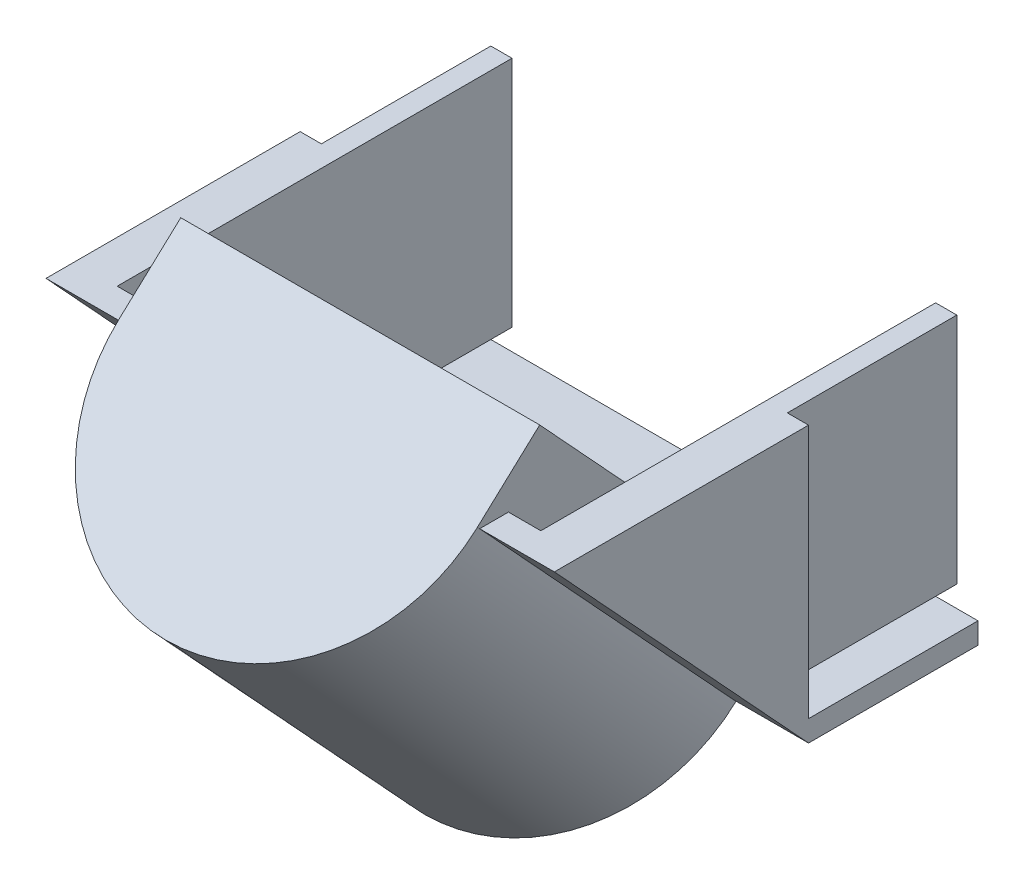
ISO-10303-21;
HEADER;
FILE_DESCRIPTION(('STEP AP214'),'2;1');
FILE_NAME('part.step','',(''),(''),'','','');
FILE_SCHEMA(('AUTOMOTIVE_DESIGN { 1 0 10303 214 1 1 1 1 }'));
ENDSEC;
DATA;
#1=APPLICATION_CONTEXT('core data for automotive mechanical design processes');
#2=APPLICATION_PROTOCOL_DEFINITION('international standard','automotive_design',2000,#1);
#3=PRODUCT_CONTEXT('',#1,'mechanical');
#4=PRODUCT('Part','Part','',(#3));
#5=PRODUCT_RELATED_PRODUCT_CATEGORY('part','',(#4));
#6=PRODUCT_DEFINITION_FORMATION('','',#4);
#7=PRODUCT_DEFINITION_CONTEXT('part definition',#1,'design');
#8=PRODUCT_DEFINITION('design','',#6,#7);
#9=PRODUCT_DEFINITION_SHAPE('','',#8);
#10=(LENGTH_UNIT() NAMED_UNIT(*) SI_UNIT(.MILLI.,.METRE.));
#11=(NAMED_UNIT(*) PLANE_ANGLE_UNIT() SI_UNIT($,.RADIAN.));
#12=(NAMED_UNIT(*) SI_UNIT($,.STERADIAN.) SOLID_ANGLE_UNIT());
#13=UNCERTAINTY_MEASURE_WITH_UNIT(LENGTH_MEASURE(1.E-05),#10,'distance_accuracy_value','');
#14=(GEOMETRIC_REPRESENTATION_CONTEXT(3) GLOBAL_UNCERTAINTY_ASSIGNED_CONTEXT((#13)) GLOBAL_UNIT_ASSIGNED_CONTEXT((#10,
#11,#12)) REPRESENTATION_CONTEXT('',''));
#15=CARTESIAN_POINT('',(0.,0.,0.));
#16=DIRECTION('',(0.,0.,1.));
#17=DIRECTION('',(1.,0.,0.));
#18=AXIS2_PLACEMENT_3D('',#15,#16,#17);
#19=CARTESIAN_POINT('',(-76.2,82.55,0.));
#20=DIRECTION('',(0.,1.,0.));
#21=DIRECTION('',(0.,0.,1.));
#22=AXIS2_PLACEMENT_3D('',#19,#20,#21);
#23=PLANE('',#22);
#24=DIRECTION('',(0.,0.,-1.));
#25=VECTOR('',#24,1.);
#26=CARTESIAN_POINT('',(53.798871558755,82.55,0.));
#27=LINE('',#26,#25);
#28=CARTESIAN_POINT('',(53.798871558755,82.55,76.2));
#29=VERTEX_POINT('',#28);
#30=CARTESIAN_POINT('',(53.7988715587551,82.55,67.5582332167494));
#31=VERTEX_POINT('',#30);
#32=EDGE_CURVE('E320',#29,#31,#27,.T.);
#33=ORIENTED_EDGE('',*,*,#32,.F.);
#34=DIRECTION('',(1.,0.,0.));
#35=VECTOR('',#34,1.);
#36=CARTESIAN_POINT('',(-76.2,82.55,76.2));
#37=LINE('',#36,#35);
#38=CARTESIAN_POINT('',(76.2,82.55,76.2));
#39=VERTEX_POINT('',#38);
#40=EDGE_CURVE('E488',#29,#39,#37,.T.);
#41=ORIENTED_EDGE('',*,*,#40,.T.);
#42=DIRECTION('',(0.,0.,1.));
#43=VECTOR('',#42,1.);
#44=CARTESIAN_POINT('',(76.2,82.55,0.));
#45=LINE('',#44,#43);
#46=CARTESIAN_POINT('',(76.2,82.55,0.));
#47=VERTEX_POINT('',#46);
#48=EDGE_CURVE('E398',#47,#39,#45,.T.);
#49=ORIENTED_EDGE('',*,*,#48,.F.);
#50=DIRECTION('',(1.,0.,0.));
#51=VECTOR('',#50,1.);
#52=CARTESIAN_POINT('',(-76.2,82.55,0.));
#53=LINE('',#52,#51);
#54=CARTESIAN_POINT('',(69.85,82.55,0.));
#55=VERTEX_POINT('',#54);
#56=EDGE_CURVE('E493',#55,#47,#53,.T.);
#57=ORIENTED_EDGE('',*,*,#56,.F.);
#58=DIRECTION('',(0.,0.,1.));
#59=VECTOR('',#58,1.);
#60=CARTESIAN_POINT('',(69.85,82.55,-50.8));
#61=LINE('',#60,#59);
#62=CARTESIAN_POINT('',(69.85,82.55,-50.8));
#63=VERTEX_POINT('',#62);
#64=EDGE_CURVE('E411',#63,#55,#61,.T.);
#65=ORIENTED_EDGE('',*,*,#64,.F.);
#66=DIRECTION('',(1.,0.,0.));
#67=VECTOR('',#66,1.);
#68=CARTESIAN_POINT('',(69.85,82.55,-50.8));
#69=LINE('',#68,#67);
#70=CARTESIAN_POINT('',(63.5,82.55,-50.8));
#71=VERTEX_POINT('',#70);
#72=EDGE_CURVE('E415',#71,#63,#69,.T.);
#73=ORIENTED_EDGE('',*,*,#72,.F.);
#74=DIRECTION('',(0.,0.,1.));
#75=VECTOR('',#74,1.);
#76=CARTESIAN_POINT('',(63.5,82.55,-50.8));
#77=LINE('',#76,#75);
#78=CARTESIAN_POINT('',(63.4999999999999,82.55,67.5582332167494));
#79=VERTEX_POINT('',#78);
#80=EDGE_CURVE('E407',#71,#79,#77,.T.);
#81=ORIENTED_EDGE('',*,*,#80,.T.);
#82=DIRECTION('',(1.,0.,0.));
#83=VECTOR('',#82,1.);
#84=CARTESIAN_POINT('',(63.4999999999999,82.55,67.5582332167494));
#85=LINE('',#84,#83);
#86=EDGE_CURVE('E353',#31,#79,#85,.T.);
#87=ORIENTED_EDGE('',*,*,#86,.F.);
#88=EDGE_LOOP('',(#33,#41,#49,#57,#65,#73,#81,#87));
#89=FACE_BOUND('',#88,.T.);
#90=ADVANCED_FACE('F49',(#89),#23,.T.);
#91=CARTESIAN_POINT('',(-76.2,0.,0.));
#92=DIRECTION('',(0.,0.,-1.));
#93=DIRECTION('',(-1.,0.,0.));
#94=AXIS2_PLACEMENT_3D('',#91,#92,#93);
#95=PLANE('',#94);
#96=DIRECTION('',(0.,-1.,0.));
#97=VECTOR('',#96,1.);
#98=CARTESIAN_POINT('',(53.7988715587551,0.,0.));
#99=LINE('',#98,#97);
#100=CARTESIAN_POINT('',(53.798871558755,12.6999999999999,0.));
#101=VERTEX_POINT('',#100);
#102=CARTESIAN_POINT('',(53.7988715587551,6.35,0.));
#103=VERTEX_POINT('',#102);
#104=EDGE_CURVE('E317',#101,#103,#99,.T.);
#105=ORIENTED_EDGE('',*,*,#104,.F.);
#106=DIRECTION('',(-1.,0.,0.));
#107=VECTOR('',#106,1.);
#108=CARTESIAN_POINT('',(63.4999999999999,12.6999999999999,0.));
#109=LINE('',#108,#107);
#110=CARTESIAN_POINT('',(63.4999999999999,12.6999999999999,0.));
#111=VERTEX_POINT('',#110);
#112=EDGE_CURVE('E334',#111,#101,#109,.T.);
#113=ORIENTED_EDGE('',*,*,#112,.F.);
#114=DIRECTION('',(-1.,0.,0.));
#115=VECTOR('',#114,1.);
#116=CARTESIAN_POINT('',(69.85,12.7,0.));
#117=LINE('',#116,#115);
#118=CARTESIAN_POINT('',(69.85,12.7,0.));
#119=VERTEX_POINT('',#118);
#120=EDGE_CURVE('E73',#119,#111,#117,.T.);
#121=ORIENTED_EDGE('',*,*,#120,.F.);
#122=DIRECTION('',(0.,-1.,0.));
#123=VECTOR('',#122,1.);
#124=CARTESIAN_POINT('',(69.85,82.55,0.));
#125=LINE('',#124,#123);
#126=EDGE_CURVE('E418',#55,#119,#125,.T.);
#127=ORIENTED_EDGE('',*,*,#126,.F.);
#128=ORIENTED_EDGE('',*,*,#56,.T.);
#129=DIRECTION('',(0.,1.,0.));
#130=VECTOR('',#129,1.);
#131=CARTESIAN_POINT('',(76.2,0.,0.));
#132=LINE('',#131,#130);
#133=CARTESIAN_POINT('',(76.2,6.35,0.));
#134=VERTEX_POINT('',#133);
#135=EDGE_CURVE('E475',#134,#47,#132,.T.);
#136=ORIENTED_EDGE('',*,*,#135,.F.);
#137=DIRECTION('',(1.,0.,0.));
#138=VECTOR('',#137,1.);
#139=CARTESIAN_POINT('',(76.2,6.35,0.));
#140=LINE('',#139,#138);
#141=EDGE_CURVE('E382',#103,#134,#140,.T.);
#142=ORIENTED_EDGE('',*,*,#141,.F.);
#143=EDGE_LOOP('',(#105,#113,#121,#127,#128,#136,#142));
#144=FACE_BOUND('',#143,.T.);
#145=ADVANCED_FACE('F519',(#144),#95,.T.);
#146=CARTESIAN_POINT('',(-76.2,82.55,76.2));
#147=DIRECTION('',(0.,-0.678280102733066,0.734803444627488));
#148=DIRECTION('',(0.,-0.734803444627488,-0.678280102733066));
#149=AXIS2_PLACEMENT_3D('',#146,#147,#148);
#150=PLANE('',#149);
#151=ORIENTED_EDGE('',*,*,#40,.F.);
#152=DIRECTION('',(0.,0.734803444627488,0.678280102733066));
#153=VECTOR('',#152,1.);
#154=CARTESIAN_POINT('',(53.798871558755,-0.719016860460955,-0.663707871194699));
#155=LINE('',#154,#153);
#156=CARTESIAN_POINT('',(53.798871558755,0.,0.));
#157=VERTEX_POINT('',#156);
#158=EDGE_CURVE('E287',#157,#29,#155,.T.);
#159=ORIENTED_EDGE('',*,*,#158,.F.);
#160=DIRECTION('',(1.,0.,0.));
#161=VECTOR('',#160,1.);
#162=CARTESIAN_POINT('',(-76.2,0.,0.));
#163=LINE('',#162,#161);
#164=CARTESIAN_POINT('',(76.2,0.,0.));
#165=VERTEX_POINT('',#164);
#166=EDGE_CURVE('E498',#157,#165,#163,.T.);
#167=ORIENTED_EDGE('',*,*,#166,.T.);
#168=DIRECTION('',(0.,-0.734803444627488,-0.678280102733066));
#169=VECTOR('',#168,1.);
#170=CARTESIAN_POINT('',(76.2,82.55,76.2));
#171=LINE('',#170,#169);
#172=EDGE_CURVE('E471',#39,#165,#171,.T.);
#173=ORIENTED_EDGE('',*,*,#172,.F.);
#174=EDGE_LOOP('',(#151,#159,#167,#173));
#175=FACE_BOUND('',#174,.T.);
#176=ADVANCED_FACE('F563',(#175),#150,.T.);
#177=CARTESIAN_POINT('',(-76.2,86.8570786523549,71.5339981266155));
#178=DIRECTION('',(0.,-0.678280102733066,0.734803444627488));
#179=DIRECTION('',(0.,-0.734803444627488,-0.678280102733066));
#180=AXIS2_PLACEMENT_3D('',#177,#178,#179);
#181=PLANE('',#180);
#182=DIRECTION('',(-1.,0.,0.));
#183=VECTOR('',#182,1.);
#184=CARTESIAN_POINT('',(63.4999999999999,12.6999999999999,3.08131013982618));
#185=LINE('',#184,#183);
#186=CARTESIAN_POINT('',(63.4999999999999,12.6999999999999,3.08131013982618));
#187=VERTEX_POINT('',#186);
#188=CARTESIAN_POINT('',(53.798871558755,12.6999999999999,3.08131013982624));
#189=VERTEX_POINT('',#188);
#190=EDGE_CURVE('E339',#187,#189,#185,.T.);
#191=ORIENTED_EDGE('',*,*,#190,.T.);
#192=DIRECTION('',(0.,0.734803444627488,0.678280102733066));
#193=VECTOR('',#192,1.);
#194=CARTESIAN_POINT('',(53.7988715587551,86.8570786523549,71.5339981266155));
#195=LINE('',#194,#193);
#196=EDGE_CURVE('E313',#189,#31,#195,.T.);
#197=ORIENTED_EDGE('',*,*,#196,.T.);
#198=ORIENTED_EDGE('',*,*,#86,.T.);
#199=DIRECTION('',(0.,-0.734803444627488,-0.678280102733066));
#200=VECTOR('',#199,1.);
#201=CARTESIAN_POINT('',(63.4999999999999,154.922167069017,134.363310511226));
#202=LINE('',#201,#200);
#203=EDGE_CURVE('E344',#79,#187,#202,.T.);
#204=ORIENTED_EDGE('',*,*,#203,.T.);
#205=EDGE_LOOP('',(#191,#197,#198,#204));
#206=FACE_BOUND('',#205,.T.);
#207=ADVANCED_FACE('F510',(#206),#181,.F.);
#208=CARTESIAN_POINT('',(63.4999999999999,12.6999999999999,212.766491502661));
#209=DIRECTION('',(0.,-1.,0.));
#210=DIRECTION('',(0.,0.,-1.));
#211=AXIS2_PLACEMENT_3D('',#208,#209,#210);
#212=PLANE('',#211);
#213=ORIENTED_EDGE('',*,*,#112,.T.);
#214=DIRECTION('',(0.,0.,1.));
#215=VECTOR('',#214,1.);
#216=CARTESIAN_POINT('',(53.7988715587551,12.6999999999999,212.766491502661));
#217=LINE('',#216,#215);
#218=EDGE_CURVE('E58',#101,#189,#217,.T.);
#219=ORIENTED_EDGE('',*,*,#218,.T.);
#220=ORIENTED_EDGE('',*,*,#190,.F.);
#221=DIRECTION('',(0.,0.,-1.));
#222=VECTOR('',#221,1.);
#223=CARTESIAN_POINT('',(63.4999999999999,12.6999999999999,212.766491502661));
#224=LINE('',#223,#222);
#225=EDGE_CURVE('E348',#187,#111,#224,.T.);
#226=ORIENTED_EDGE('',*,*,#225,.T.);
#227=EDGE_LOOP('',(#213,#219,#220,#226));
#228=FACE_BOUND('',#227,.T.);
#229=ADVANCED_FACE('F507',(#228),#212,.F.);
#230=DIRECTION('',(0.,0.,1.));
#231=VECTOR('',#230,1.);
#232=CARTESIAN_POINT('',(-53.798871558755,82.55,0.));
#233=LINE('',#232,#231);
#234=CARTESIAN_POINT('',(-53.798871558755,82.55,67.5582332167494));
#235=VERTEX_POINT('',#234);
#236=CARTESIAN_POINT('',(-53.798871558755,82.55,76.2));
#237=VERTEX_POINT('',#236);
#238=EDGE_CURVE('E302',#235,#237,#233,.T.);
#239=ORIENTED_EDGE('',*,*,#238,.F.);
#240=CARTESIAN_POINT('',(-63.5,82.55,67.5582332167493));
#241=VERTEX_POINT('',#240);
#242=EDGE_CURVE('E349',#241,#235,#85,.T.);
#243=ORIENTED_EDGE('',*,*,#242,.F.);
#244=DIRECTION('',(0.,0.,1.));
#245=VECTOR('',#244,1.);
#246=CARTESIAN_POINT('',(-63.5000000000001,82.5499999999999,-50.8));
#247=LINE('',#246,#245);
#248=CARTESIAN_POINT('',(-63.5000000000001,82.5499999999999,-50.8));
#249=VERTEX_POINT('',#248);
#250=EDGE_CURVE('E437',#249,#241,#247,.T.);
#251=ORIENTED_EDGE('',*,*,#250,.F.);
#252=DIRECTION('',(1.,0.,0.));
#253=VECTOR('',#252,1.);
#254=CARTESIAN_POINT('',(-69.8500000000001,82.5499999999999,-50.8));
#255=LINE('',#254,#253);
#256=CARTESIAN_POINT('',(-69.8500000000001,82.5499999999999,-50.8));
#257=VERTEX_POINT('',#256);
#258=EDGE_CURVE('E462',#257,#249,#255,.T.);
#259=ORIENTED_EDGE('',*,*,#258,.F.);
#260=DIRECTION('',(0.,0.,1.));
#261=VECTOR('',#260,1.);
#262=CARTESIAN_POINT('',(-69.8500000000001,82.5499999999999,-50.8));
#263=LINE('',#262,#261);
#264=CARTESIAN_POINT('',(-69.85,82.55,0.));
#265=VERTEX_POINT('',#264);
#266=EDGE_CURVE('E363',#257,#265,#263,.T.);
#267=ORIENTED_EDGE('',*,*,#266,.T.);
#268=CARTESIAN_POINT('',(-76.2,82.55,0.));
#269=VERTEX_POINT('',#268);
#270=EDGE_CURVE('E489',#269,#265,#53,.T.);
#271=ORIENTED_EDGE('',*,*,#270,.F.);
#272=DIRECTION('',(0.,0.,1.));
#273=VECTOR('',#272,1.);
#274=CARTESIAN_POINT('',(-76.2,82.55,0.));
#275=LINE('',#274,#273);
#276=CARTESIAN_POINT('',(-76.2,82.55,76.2));
#277=VERTEX_POINT('',#276);
#278=EDGE_CURVE('E478',#269,#277,#275,.T.);
#279=ORIENTED_EDGE('',*,*,#278,.T.);
#280=EDGE_CURVE('E499',#277,#237,#37,.T.);
#281=ORIENTED_EDGE('',*,*,#280,.T.);
#282=EDGE_LOOP('',(#239,#243,#251,#259,#267,#271,#279,#281));
#283=FACE_BOUND('',#282,.T.);
#284=ADVANCED_FACE('F51',(#283),#23,.T.);
#285=DIRECTION('',(0.,1.,0.));
#286=VECTOR('',#285,1.);
#287=CARTESIAN_POINT('',(-53.798871558755,0.,0.));
#288=LINE('',#287,#286);
#289=CARTESIAN_POINT('',(-53.798871558755,6.35,0.));
#290=VERTEX_POINT('',#289);
#291=CARTESIAN_POINT('',(-53.798871558755,12.6999999999999,0.));
#292=VERTEX_POINT('',#291);
#293=EDGE_CURVE('E65',#290,#292,#288,.T.);
#294=ORIENTED_EDGE('',*,*,#293,.F.);
#295=CARTESIAN_POINT('',(-76.2,6.35,0.));
#296=VERTEX_POINT('',#295);
#297=EDGE_CURVE('E369',#296,#290,#140,.T.);
#298=ORIENTED_EDGE('',*,*,#297,.F.);
#299=DIRECTION('',(0.,1.,0.));
#300=VECTOR('',#299,1.);
#301=CARTESIAN_POINT('',(-76.2,0.,0.));
#302=LINE('',#301,#300);
#303=EDGE_CURVE('E485',#296,#269,#302,.T.);
#304=ORIENTED_EDGE('',*,*,#303,.T.);
#305=ORIENTED_EDGE('',*,*,#270,.T.);
#306=DIRECTION('',(0.,1.,0.));
#307=VECTOR('',#306,1.);
#308=CARTESIAN_POINT('',(-69.8500000000001,82.5499999999999,0.));
#309=LINE('',#308,#307);
#310=CARTESIAN_POINT('',(-69.85,12.6999999999999,0.));
#311=VERTEX_POINT('',#310);
#312=EDGE_CURVE('E403',#311,#265,#309,.T.);
#313=ORIENTED_EDGE('',*,*,#312,.F.);
#314=DIRECTION('',(-1.,0.,0.));
#315=VECTOR('',#314,1.);
#316=CARTESIAN_POINT('',(-69.85,12.6999999999999,0.));
#317=LINE('',#316,#315);
#318=CARTESIAN_POINT('',(-63.5,12.6999999999999,0.));
#319=VERTEX_POINT('',#318);
#320=EDGE_CURVE('E449',#319,#311,#317,.T.);
#321=ORIENTED_EDGE('',*,*,#320,.F.);
#322=EDGE_CURVE('E333',#292,#319,#109,.T.);
#323=ORIENTED_EDGE('',*,*,#322,.F.);
#324=EDGE_LOOP('',(#294,#298,#304,#305,#313,#321,#323));
#325=FACE_BOUND('',#324,.T.);
#326=ADVANCED_FACE('F574',(#325),#95,.T.);
#327=DIRECTION('',(0.,0.734803444627488,0.678280102733066));
#328=VECTOR('',#327,1.);
#329=CARTESIAN_POINT('',(-53.798871558755,-0.719016860460955,-0.663707871194699));
#330=LINE('',#329,#328);
#331=CARTESIAN_POINT('',(-53.798871558755,0.,0.));
#332=VERTEX_POINT('',#331);
#333=EDGE_CURVE('E293',#332,#237,#330,.T.);
#334=ORIENTED_EDGE('',*,*,#333,.T.);
#335=ORIENTED_EDGE('',*,*,#280,.F.);
#336=DIRECTION('',(0.,-0.734803444627488,-0.678280102733066));
#337=VECTOR('',#336,1.);
#338=CARTESIAN_POINT('',(-76.2,82.55,76.2));
#339=LINE('',#338,#337);
#340=CARTESIAN_POINT('',(-76.2,0.,0.));
#341=VERTEX_POINT('',#340);
#342=EDGE_CURVE('E482',#277,#341,#339,.T.);
#343=ORIENTED_EDGE('',*,*,#342,.T.);
#344=EDGE_CURVE('E494',#341,#332,#163,.T.);
#345=ORIENTED_EDGE('',*,*,#344,.T.);
#346=EDGE_LOOP('',(#334,#335,#343,#345));
#347=FACE_BOUND('',#346,.T.);
#348=ADVANCED_FACE('F607',(#347),#150,.T.);
#349=CARTESIAN_POINT('',(-76.2,0.,0.));
#350=DIRECTION('',(-1.,0.,0.));
#351=DIRECTION('',(0.,0.,1.));
#352=AXIS2_PLACEMENT_3D('',#349,#350,#351);
#353=PLANE('',#352);
#354=ORIENTED_EDGE('',*,*,#278,.F.);
#355=ORIENTED_EDGE('',*,*,#303,.F.);
#356=DIRECTION('',(0.,0.,1.));
#357=VECTOR('',#356,1.);
#358=CARTESIAN_POINT('',(-76.2,6.35,-50.8));
#359=LINE('',#358,#357);
#360=CARTESIAN_POINT('',(-76.2,6.35,-50.8));
#361=VERTEX_POINT('',#360);
#362=EDGE_CURVE('E386',#361,#296,#359,.T.);
#363=ORIENTED_EDGE('',*,*,#362,.F.);
#364=DIRECTION('',(0.,1.,0.));
#365=VECTOR('',#364,1.);
#366=CARTESIAN_POINT('',(-76.2,0.,-50.8));
#367=LINE('',#366,#365);
#368=CARTESIAN_POINT('',(-76.2,0.,-50.8));
#369=VERTEX_POINT('',#368);
#370=EDGE_CURVE('E372',#369,#361,#367,.T.);
#371=ORIENTED_EDGE('',*,*,#370,.F.);
#372=DIRECTION('',(0.,0.,1.));
#373=VECTOR('',#372,1.);
#374=CARTESIAN_POINT('',(-76.2,0.,-50.8));
#375=LINE('',#374,#373);
#376=EDGE_CURVE('E390',#369,#341,#375,.T.);
#377=ORIENTED_EDGE('',*,*,#376,.T.);
#378=ORIENTED_EDGE('',*,*,#342,.F.);
#379=EDGE_LOOP('',(#354,#355,#363,#371,#377,#378));
#380=FACE_BOUND('',#379,.T.);
#381=ADVANCED_FACE('F581',(#380),#353,.T.);
#382=CARTESIAN_POINT('',(76.2,0.,0.));
#383=DIRECTION('',(-1.,0.,0.));
#384=DIRECTION('',(0.,0.,1.));
#385=AXIS2_PLACEMENT_3D('',#382,#383,#384);
#386=PLANE('',#385);
#387=ORIENTED_EDGE('',*,*,#48,.T.);
#388=ORIENTED_EDGE('',*,*,#172,.T.);
#389=DIRECTION('',(0.,0.,1.));
#390=VECTOR('',#389,1.);
#391=CARTESIAN_POINT('',(76.2,0.,-50.8));
#392=LINE('',#391,#390);
#393=CARTESIAN_POINT('',(76.2,0.,-50.8));
#394=VERTEX_POINT('',#393);
#395=EDGE_CURVE('E394',#394,#165,#392,.T.);
#396=ORIENTED_EDGE('',*,*,#395,.F.);
#397=DIRECTION('',(0.,-1.,0.));
#398=VECTOR('',#397,1.);
#399=CARTESIAN_POINT('',(76.2,0.,-50.8));
#400=LINE('',#399,#398);
#401=CARTESIAN_POINT('',(76.2,6.35,-50.8));
#402=VERTEX_POINT('',#401);
#403=EDGE_CURVE('E364',#402,#394,#400,.T.);
#404=ORIENTED_EDGE('',*,*,#403,.F.);
#405=DIRECTION('',(0.,0.,1.));
#406=VECTOR('',#405,1.);
#407=CARTESIAN_POINT('',(76.2,6.35,-50.8));
#408=LINE('',#407,#406);
#409=EDGE_CURVE('E378',#402,#134,#408,.T.);
#410=ORIENTED_EDGE('',*,*,#409,.T.);
#411=ORIENTED_EDGE('',*,*,#135,.T.);
#412=EDGE_LOOP('',(#387,#388,#396,#404,#410,#411));
#413=FACE_BOUND('',#412,.T.);
#414=ADVANCED_FACE('F566',(#413),#386,.F.);
#415=CARTESIAN_POINT('',(-69.8500000000001,82.5499999999999,-50.8));
#416=DIRECTION('',(1.,0.,0.));
#417=DIRECTION('',(0.,1.,0.));
#418=AXIS2_PLACEMENT_3D('',#415,#416,#417);
#419=PLANE('',#418);
#420=ORIENTED_EDGE('',*,*,#312,.T.);
#421=ORIENTED_EDGE('',*,*,#266,.F.);
#422=DIRECTION('',(0.,1.,0.));
#423=VECTOR('',#422,1.);
#424=CARTESIAN_POINT('',(-69.8500000000001,82.5499999999999,-50.8));
#425=LINE('',#424,#423);
#426=CARTESIAN_POINT('',(-69.85,12.6999999999999,-50.8));
#427=VERTEX_POINT('',#426);
#428=EDGE_CURVE('E453',#427,#257,#425,.T.);
#429=ORIENTED_EDGE('',*,*,#428,.F.);
#430=DIRECTION('',(0.,0.,1.));
#431=VECTOR('',#430,1.);
#432=CARTESIAN_POINT('',(-69.85,12.6999999999999,-50.8));
#433=LINE('',#432,#431);
#434=EDGE_CURVE('E444',#427,#311,#433,.T.);
#435=ORIENTED_EDGE('',*,*,#434,.T.);
#436=EDGE_LOOP('',(#420,#421,#429,#435));
#437=FACE_BOUND('',#436,.T.);
#438=ADVANCED_FACE('F589',(#437),#419,.F.);
#439=CARTESIAN_POINT('',(-63.5000000000001,82.5499999999999,-50.8));
#440=DIRECTION('',(-1.,0.,0.));
#441=DIRECTION('',(0.,-1.,0.));
#442=AXIS2_PLACEMENT_3D('',#439,#440,#441);
#443=PLANE('',#442);
#444=ORIENTED_EDGE('',*,*,#250,.T.);
#445=DIRECTION('',(0.,0.734803444627488,0.678280102733066));
#446=VECTOR('',#445,1.);
#447=CARTESIAN_POINT('',(-63.5,154.922167069017,134.363310511226));
#448=LINE('',#447,#446);
#449=CARTESIAN_POINT('',(-63.5,12.6999999999999,3.08131013982624));
#450=VERTEX_POINT('',#449);
#451=EDGE_CURVE('E354',#450,#241,#448,.T.);
#452=ORIENTED_EDGE('',*,*,#451,.F.);
#453=DIRECTION('',(0.,0.,-1.));
#454=VECTOR('',#453,1.);
#455=CARTESIAN_POINT('',(-63.5,12.6999999999999,212.766491502661));
#456=LINE('',#455,#454);
#457=EDGE_CURVE('E343',#450,#319,#456,.T.);
#458=ORIENTED_EDGE('',*,*,#457,.T.);
#459=DIRECTION('',(0.,0.,1.));
#460=VECTOR('',#459,1.);
#461=CARTESIAN_POINT('',(-63.5,12.6999999999999,-50.8));
#462=LINE('',#461,#460);
#463=CARTESIAN_POINT('',(-63.5,12.6999999999999,-50.8));
#464=VERTEX_POINT('',#463);
#465=EDGE_CURVE('E440',#464,#319,#462,.T.);
#466=ORIENTED_EDGE('',*,*,#465,.F.);
#467=DIRECTION('',(0.,-1.,0.));
#468=VECTOR('',#467,1.);
#469=CARTESIAN_POINT('',(-63.5000000000001,82.5499999999999,-50.8));
#470=LINE('',#469,#468);
#471=EDGE_CURVE('E459',#249,#464,#470,.T.);
#472=ORIENTED_EDGE('',*,*,#471,.F.);
#473=EDGE_LOOP('',(#444,#452,#458,#466,#472));
#474=FACE_BOUND('',#473,.T.);
#475=ADVANCED_FACE('F597',(#474),#443,.F.);
#476=CARTESIAN_POINT('',(-69.85,12.6999999999999,-50.8));
#477=DIRECTION('',(0.,1.,0.));
#478=DIRECTION('',(-1.,0.,0.));
#479=AXIS2_PLACEMENT_3D('',#476,#477,#478);
#480=PLANE('',#479);
#481=ORIENTED_EDGE('',*,*,#320,.T.);
#482=ORIENTED_EDGE('',*,*,#434,.F.);
#483=DIRECTION('',(-1.,0.,0.));
#484=VECTOR('',#483,1.);
#485=CARTESIAN_POINT('',(-69.85,12.6999999999999,-50.8));
#486=LINE('',#485,#484);
#487=EDGE_CURVE('E448',#464,#427,#486,.T.);
#488=ORIENTED_EDGE('',*,*,#487,.F.);
#489=ORIENTED_EDGE('',*,*,#465,.T.);
#490=EDGE_LOOP('',(#481,#482,#488,#489));
#491=FACE_BOUND('',#490,.T.);
#492=ADVANCED_FACE('F592',(#491),#480,.F.);
#493=CARTESIAN_POINT('',(0.,0.,-50.8));
#494=DIRECTION('',(0.,0.,1.));
#495=DIRECTION('',(1.,0.,0.));
#496=AXIS2_PLACEMENT_3D('',#493,#494,#495);
#497=PLANE('',#496);
#498=ORIENTED_EDGE('',*,*,#428,.T.);
#499=ORIENTED_EDGE('',*,*,#258,.T.);
#500=ORIENTED_EDGE('',*,*,#471,.T.);
#501=ORIENTED_EDGE('',*,*,#487,.T.);
#502=EDGE_LOOP('',(#498,#499,#500,#501));
#503=FACE_BOUND('',#502,.T.);
#504=ADVANCED_FACE('F800',(#503),#497,.F.);
#505=CARTESIAN_POINT('',(69.85,82.55,-50.8));
#506=DIRECTION('',(-1.,0.,0.));
#507=DIRECTION('',(0.,-1.,0.));
#508=AXIS2_PLACEMENT_3D('',#505,#506,#507);
#509=PLANE('',#508);
#510=ORIENTED_EDGE('',*,*,#126,.T.);
#511=DIRECTION('',(0.,0.,1.));
#512=VECTOR('',#511,1.);
#513=CARTESIAN_POINT('',(69.85,12.7,-50.8));
#514=LINE('',#513,#512);
#515=CARTESIAN_POINT('',(69.85,12.7,-50.8));
#516=VERTEX_POINT('',#515);
#517=EDGE_CURVE('E399',#516,#119,#514,.T.);
#518=ORIENTED_EDGE('',*,*,#517,.F.);
#519=DIRECTION('',(0.,-1.,0.));
#520=VECTOR('',#519,1.);
#521=CARTESIAN_POINT('',(69.85,82.55,-50.8));
#522=LINE('',#521,#520);
#523=EDGE_CURVE('E419',#63,#516,#522,.T.);
#524=ORIENTED_EDGE('',*,*,#523,.F.);
#525=ORIENTED_EDGE('',*,*,#64,.T.);
#526=EDGE_LOOP('',(#510,#518,#524,#525));
#527=FACE_BOUND('',#526,.T.);
#528=ADVANCED_FACE('F526',(#527),#509,.F.);
#529=CARTESIAN_POINT('',(69.85,12.7,-50.8));
#530=DIRECTION('',(0.,1.,0.));
#531=DIRECTION('',(0.,0.,1.));
#532=AXIS2_PLACEMENT_3D('',#529,#530,#531);
#533=PLANE('',#532);
#534=ORIENTED_EDGE('',*,*,#120,.T.);
#535=DIRECTION('',(0.,0.,1.));
#536=VECTOR('',#535,1.);
#537=CARTESIAN_POINT('',(63.5,12.7,-50.8));
#538=LINE('',#537,#536);
#539=CARTESIAN_POINT('',(63.5,12.7,-50.8));
#540=VERTEX_POINT('',#539);
#541=EDGE_CURVE('E402',#540,#111,#538,.T.);
#542=ORIENTED_EDGE('',*,*,#541,.F.);
#543=DIRECTION('',(-1.,0.,0.));
#544=VECTOR('',#543,1.);
#545=CARTESIAN_POINT('',(69.85,12.7,-50.8));
#546=LINE('',#545,#544);
#547=EDGE_CURVE('E428',#516,#540,#546,.T.);
#548=ORIENTED_EDGE('',*,*,#547,.F.);
#549=ORIENTED_EDGE('',*,*,#517,.T.);
#550=EDGE_LOOP('',(#534,#542,#548,#549));
#551=FACE_BOUND('',#550,.T.);
#552=ADVANCED_FACE('F522',(#551),#533,.F.);
#553=CARTESIAN_POINT('',(63.5,82.55,-50.8));
#554=DIRECTION('',(1.,0.,0.));
#555=DIRECTION('',(0.,1.,0.));
#556=AXIS2_PLACEMENT_3D('',#553,#554,#555);
#557=PLANE('',#556);
#558=ORIENTED_EDGE('',*,*,#541,.T.);
#559=ORIENTED_EDGE('',*,*,#225,.F.);
#560=ORIENTED_EDGE('',*,*,#203,.F.);
#561=ORIENTED_EDGE('',*,*,#80,.F.);
#562=DIRECTION('',(0.,1.,0.));
#563=VECTOR('',#562,1.);
#564=CARTESIAN_POINT('',(63.5,82.55,-50.8));
#565=LINE('',#564,#563);
#566=EDGE_CURVE('E425',#540,#71,#565,.T.);
#567=ORIENTED_EDGE('',*,*,#566,.F.);
#568=EDGE_LOOP('',(#558,#559,#560,#561,#567));
#569=FACE_BOUND('',#568,.T.);
#570=ADVANCED_FACE('F516',(#569),#557,.F.);
#571=CARTESIAN_POINT('',(0.,0.,-50.8));
#572=DIRECTION('',(0.,0.,-1.));
#573=DIRECTION('',(-1.,0.,0.));
#574=AXIS2_PLACEMENT_3D('',#571,#572,#573);
#575=PLANE('',#574);
#576=ORIENTED_EDGE('',*,*,#523,.T.);
#577=ORIENTED_EDGE('',*,*,#547,.T.);
#578=ORIENTED_EDGE('',*,*,#566,.T.);
#579=ORIENTED_EDGE('',*,*,#72,.T.);
#580=EDGE_LOOP('',(#576,#577,#578,#579));
#581=FACE_BOUND('',#580,.T.);
#582=ADVANCED_FACE('F772',(#581),#575,.T.);
#583=CARTESIAN_POINT('',(76.2,0.,-50.8));
#584=DIRECTION('',(0.,1.,0.));
#585=DIRECTION('',(0.,0.,1.));
#586=AXIS2_PLACEMENT_3D('',#583,#584,#585);
#587=PLANE('',#586);
#588=ORIENTED_EDGE('',*,*,#166,.F.);
#589=DIRECTION('',(0.,0.,-1.));
#590=VECTOR('',#589,1.);
#591=CARTESIAN_POINT('',(53.798871558755,0.,-50.8));
#592=LINE('',#591,#590);
#593=CARTESIAN_POINT('',(53.798871558755,0.,-1.44264280336073));
#594=VERTEX_POINT('',#593);
#595=EDGE_CURVE('E325',#157,#594,#592,.T.);
#596=ORIENTED_EDGE('',*,*,#595,.T.);
#597=DIRECTION('',(-1.,0.,0.));
#598=VECTOR('',#597,1.);
#599=CARTESIAN_POINT('',(76.2,0.,-1.44264280336073));
#600=LINE('',#599,#598);
#601=CARTESIAN_POINT('',(-53.798871558755,0.,-1.44264280336073));
#602=VERTEX_POINT('',#601);
#603=EDGE_CURVE('E329',#594,#602,#600,.T.);
#604=ORIENTED_EDGE('',*,*,#603,.T.);
#605=DIRECTION('',(0.,0.,1.));
#606=VECTOR('',#605,1.);
#607=CARTESIAN_POINT('',(-53.798871558755,0.,-50.8));
#608=LINE('',#607,#606);
#609=EDGE_CURVE('E309',#602,#332,#608,.T.);
#610=ORIENTED_EDGE('',*,*,#609,.T.);
#611=ORIENTED_EDGE('',*,*,#344,.F.);
#612=ORIENTED_EDGE('',*,*,#376,.F.);
#613=DIRECTION('',(-1.,0.,0.));
#614=VECTOR('',#613,1.);
#615=CARTESIAN_POINT('',(76.2,0.,-50.8));
#616=LINE('',#615,#614);
#617=EDGE_CURVE('E368',#394,#369,#616,.T.);
#618=ORIENTED_EDGE('',*,*,#617,.F.);
#619=ORIENTED_EDGE('',*,*,#395,.T.);
#620=EDGE_LOOP('',(#588,#596,#604,#610,#611,#612,#618,#619));
#621=FACE_BOUND('',#620,.T.);
#622=ADVANCED_FACE('F611',(#621),#587,.F.);
#623=CARTESIAN_POINT('',(76.2,6.35,-50.8));
#624=DIRECTION('',(0.,-1.,0.));
#625=DIRECTION('',(0.,0.,-1.));
#626=AXIS2_PLACEMENT_3D('',#623,#624,#625);
#627=PLANE('',#626);
#628=DIRECTION('',(1.,0.,0.));
#629=VECTOR('',#628,1.);
#630=CARTESIAN_POINT('',(76.2,6.35,-8.3218094700274));
#631=LINE('',#630,#629);
#632=CARTESIAN_POINT('',(-53.798871558755,6.35000000000001,-8.32180947002739));
#633=VERTEX_POINT('',#632);
#634=CARTESIAN_POINT('',(53.798871558755,6.35,-8.3218094700274));
#635=VERTEX_POINT('',#634);
#636=EDGE_CURVE('E12',#633,#635,#631,.T.);
#637=ORIENTED_EDGE('',*,*,#636,.T.);
#638=DIRECTION('',(0.,0.,1.));
#639=VECTOR('',#638,1.);
#640=CARTESIAN_POINT('',(53.798871558755,6.35,-50.8));
#641=LINE('',#640,#639);
#642=EDGE_CURVE('E236',#635,#103,#641,.T.);
#643=ORIENTED_EDGE('',*,*,#642,.T.);
#644=ORIENTED_EDGE('',*,*,#141,.T.);
#645=ORIENTED_EDGE('',*,*,#409,.F.);
#646=DIRECTION('',(1.,0.,0.));
#647=VECTOR('',#646,1.);
#648=CARTESIAN_POINT('',(76.2,6.35,-50.8));
#649=LINE('',#648,#647);
#650=EDGE_CURVE('E375',#361,#402,#649,.T.);
#651=ORIENTED_EDGE('',*,*,#650,.F.);
#652=ORIENTED_EDGE('',*,*,#362,.T.);
#653=ORIENTED_EDGE('',*,*,#297,.T.);
#654=DIRECTION('',(0.,0.,-1.));
#655=VECTOR('',#654,1.);
#656=CARTESIAN_POINT('',(-53.798871558755,6.35,-50.8));
#657=LINE('',#656,#655);
#658=EDGE_CURVE('E305',#290,#633,#657,.T.);
#659=ORIENTED_EDGE('',*,*,#658,.T.);
#660=EDGE_LOOP('',(#637,#643,#644,#645,#651,#652,#653,#659));
#661=FACE_BOUND('',#660,.T.);
#662=ADVANCED_FACE('F570',(#661),#627,.F.);
#663=CARTESIAN_POINT('',(0.,0.,-50.8));
#664=DIRECTION('',(0.,0.,1.));
#665=DIRECTION('',(1.,0.,0.));
#666=AXIS2_PLACEMENT_3D('',#663,#664,#665);
#667=PLANE('',#666);
#668=ORIENTED_EDGE('',*,*,#403,.T.);
#669=ORIENTED_EDGE('',*,*,#617,.T.);
#670=ORIENTED_EDGE('',*,*,#370,.T.);
#671=ORIENTED_EDGE('',*,*,#650,.T.);
#672=EDGE_LOOP('',(#668,#669,#670,#671));
#673=FACE_BOUND('',#672,.T.);
#674=ADVANCED_FACE('F622',(#673),#667,.F.);
#675=ORIENTED_EDGE('',*,*,#242,.T.);
#676=DIRECTION('',(0.,-0.734803444627488,-0.678280102733066));
#677=VECTOR('',#676,1.);
#678=CARTESIAN_POINT('',(-53.798871558755,86.8570786523549,71.5339981266155));
#679=LINE('',#678,#677);
#680=CARTESIAN_POINT('',(-53.798871558755,12.6999999999999,3.08131013982624));
#681=VERTEX_POINT('',#680);
#682=EDGE_CURVE('E286',#235,#681,#679,.T.);
#683=ORIENTED_EDGE('',*,*,#682,.T.);
#684=EDGE_CURVE('E338',#681,#450,#185,.T.);
#685=ORIENTED_EDGE('',*,*,#684,.T.);
#686=ORIENTED_EDGE('',*,*,#451,.T.);
#687=EDGE_LOOP('',(#675,#683,#685,#686));
#688=FACE_BOUND('',#687,.T.);
#689=ADVANCED_FACE('F604',(#688),#181,.F.);
#690=ORIENTED_EDGE('',*,*,#684,.F.);
#691=DIRECTION('',(0.,0.,-1.));
#692=VECTOR('',#691,1.);
#693=CARTESIAN_POINT('',(-53.7988715587551,12.6999999999999,212.766491502661));
#694=LINE('',#693,#692);
#695=EDGE_CURVE('E492',#681,#292,#694,.T.);
#696=ORIENTED_EDGE('',*,*,#695,.T.);
#697=ORIENTED_EDGE('',*,*,#322,.T.);
#698=ORIENTED_EDGE('',*,*,#457,.F.);
#699=EDGE_LOOP('',(#690,#696,#697,#698));
#700=FACE_BOUND('',#699,.T.);
#701=ADVANCED_FACE('F602',(#700),#212,.F.);
#702=CARTESIAN_POINT('',(0.,-0.719016860460941,-0.663707871194713));
#703=DIRECTION('',(0.,-0.734803444627488,-0.678280102733066));
#704=DIRECTION('',(0.,0.678280102733066,-0.734803444627488));
#705=AXIS2_PLACEMENT_3D('',#702,#703,#704);
#706=PLANE('',#705);
#707=ORIENTED_EDGE('',*,*,#603,.F.);
#708=DIRECTION('',(0.,0.678280102733066,-0.734803444627488));
#709=VECTOR('',#708,1.);
#710=CARTESIAN_POINT('',(53.798871558755,-0.719016860460955,-0.663707871194699));
#711=LINE('',#710,#709);
#712=CARTESIAN_POINT('',(53.798871558755,-0.719016860460955,-0.663707871194699));
#713=VERTEX_POINT('',#712);
#714=EDGE_CURVE('E240',#713,#594,#711,.T.);
#715=ORIENTED_EDGE('',*,*,#714,.F.);
#716=CARTESIAN_POINT('',(0.,-0.719016860460941,-0.663707871194713));
#717=DIRECTION('',(0.,-0.734803444627488,-0.678280102733066));
#718=DIRECTION('',(0.,0.678280102733066,-0.734803444627488));
#719=AXIS2_PLACEMENT_3D('',#716,#717,#718);
#720=CIRCLE('',#719,53.798871558755);
#721=CARTESIAN_POINT('',(-53.798871558755,-0.719016860460955,-0.663707871194699));
#722=VERTEX_POINT('',#721);
#723=EDGE_CURVE('E252',#713,#722,#720,.T.);
#724=ORIENTED_EDGE('',*,*,#723,.T.);
#725=DIRECTION('',(0.,-0.678280102733066,0.734803444627488));
#726=VECTOR('',#725,1.);
#727=CARTESIAN_POINT('',(-53.798871558755,16.5092977489589,-19.3277153647329));
#728=LINE('',#727,#726);
#729=EDGE_CURVE('E259',#602,#722,#728,.T.);
#730=ORIENTED_EDGE('',*,*,#729,.F.);
#731=EDGE_LOOP('',(#707,#715,#724,#730));
#732=FACE_BOUND('',#731,.T.);
#733=ADVANCED_FACE('F617',(#732),#706,.T.);
#734=ORIENTED_EDGE('',*,*,#636,.F.);
#735=CARTESIAN_POINT('',(-53.798871558755,16.5092977489589,-19.3277153647329));
#736=VERTEX_POINT('',#735);
#737=EDGE_CURVE('E257',#736,#633,#728,.T.);
#738=ORIENTED_EDGE('',*,*,#737,.F.);
#739=DIRECTION('',(-1.,0.,0.));
#740=VECTOR('',#739,1.);
#741=CARTESIAN_POINT('',(53.798871558755,16.5092977489589,-19.3277153647329));
#742=LINE('',#741,#740);
#743=CARTESIAN_POINT('',(53.798871558755,16.5092977489589,-19.3277153647329));
#744=VERTEX_POINT('',#743);
#745=EDGE_CURVE('E246',#744,#736,#742,.T.);
#746=ORIENTED_EDGE('',*,*,#745,.F.);
#747=EDGE_CURVE('E229',#635,#744,#711,.T.);
#748=ORIENTED_EDGE('',*,*,#747,.F.);
#749=EDGE_LOOP('',(#734,#738,#746,#748));
#750=FACE_BOUND('',#749,.T.);
#751=ADVANCED_FACE('F255',(#750),#706,.T.);
#752=CARTESIAN_POINT('',(53.798871558755,-0.719016860460955,-0.663707871194699));
#753=DIRECTION('',(1.,0.,0.));
#754=DIRECTION('',(0.,0.,-1.));
#755=AXIS2_PLACEMENT_3D('',#752,#753,#754);
#756=PLANE('',#755);
#757=ORIENTED_EDGE('',*,*,#595,.F.);
#758=EDGE_CURVE('E282',#713,#157,#155,.T.);
#759=ORIENTED_EDGE('',*,*,#758,.F.);
#760=ORIENTED_EDGE('',*,*,#714,.T.);
#761=EDGE_LOOP('',(#757,#759,#760));
#762=FACE_BOUND('',#761,.T.);
#763=ADVANCED_FACE('F620',(#762),#756,.T.);
#764=ORIENTED_EDGE('',*,*,#642,.F.);
#765=ORIENTED_EDGE('',*,*,#747,.T.);
#766=DIRECTION('',(0.,0.734803444627488,0.678280102733066));
#767=VECTOR('',#766,1.);
#768=CARTESIAN_POINT('',(53.798871558755,16.5092977489589,-19.3277153647329));
#769=LINE('',#768,#767);
#770=CARTESIAN_POINT('',(53.798871558755,100.497331469881,58.1997003776565));
#771=VERTEX_POINT('',#770);
#772=EDGE_CURVE('E233',#744,#771,#769,.T.);
#773=ORIENTED_EDGE('',*,*,#772,.T.);
#774=DIRECTION('',(0.,0.678280102733066,-0.734803444627488));
#775=VECTOR('',#774,1.);
#776=CARTESIAN_POINT('',(53.798871558755,83.2690168604609,76.8637078711947));
#777=LINE('',#776,#775);
#778=CARTESIAN_POINT('',(53.798871558755,83.2690168604609,76.8637078711947));
#779=VERTEX_POINT('',#778);
#780=EDGE_CURVE('E270',#779,#771,#777,.T.);
#781=ORIENTED_EDGE('',*,*,#780,.F.);
#782=EDGE_CURVE('E288',#29,#779,#155,.T.);
#783=ORIENTED_EDGE('',*,*,#782,.F.);
#784=ORIENTED_EDGE('',*,*,#32,.T.);
#785=ORIENTED_EDGE('',*,*,#196,.F.);
#786=ORIENTED_EDGE('',*,*,#218,.F.);
#787=ORIENTED_EDGE('',*,*,#104,.T.);
#788=EDGE_LOOP('',(#764,#765,#773,#781,#783,#784,#785,#786,#787));
#789=FACE_BOUND('',#788,.T.);
#790=ADVANCED_FACE('F231',(#789),#756,.T.);
#791=CARTESIAN_POINT('',(-53.798871558755,16.5092977489589,-19.3277153647329));
#792=DIRECTION('',(-1.,0.,0.));
#793=DIRECTION('',(0.,0.,1.));
#794=AXIS2_PLACEMENT_3D('',#791,#792,#793);
#795=PLANE('',#794);
#796=ORIENTED_EDGE('',*,*,#609,.F.);
#797=ORIENTED_EDGE('',*,*,#729,.T.);
#798=EDGE_CURVE('E289',#722,#332,#330,.T.);
#799=ORIENTED_EDGE('',*,*,#798,.T.);
#800=EDGE_LOOP('',(#796,#797,#799));
#801=FACE_BOUND('',#800,.T.);
#802=ADVANCED_FACE('F614',(#801),#795,.T.);
#803=ORIENTED_EDGE('',*,*,#658,.F.);
#804=ORIENTED_EDGE('',*,*,#293,.T.);
#805=ORIENTED_EDGE('',*,*,#695,.F.);
#806=ORIENTED_EDGE('',*,*,#682,.F.);
#807=ORIENTED_EDGE('',*,*,#238,.T.);
#808=CARTESIAN_POINT('',(-53.798871558755,83.2690168604609,76.8637078711947));
#809=VERTEX_POINT('',#808);
#810=EDGE_CURVE('E294',#237,#809,#330,.T.);
#811=ORIENTED_EDGE('',*,*,#810,.T.);
#812=DIRECTION('',(0.,-0.678280102733066,0.734803444627488));
#813=VECTOR('',#812,1.);
#814=CARTESIAN_POINT('',(-53.798871558755,100.497331469881,58.1997003776565));
#815=LINE('',#814,#813);
#816=CARTESIAN_POINT('',(-53.798871558755,100.497331469881,58.1997003776565));
#817=VERTEX_POINT('',#816);
#818=EDGE_CURVE('E275',#817,#809,#815,.T.);
#819=ORIENTED_EDGE('',*,*,#818,.F.);
#820=DIRECTION('',(0.,0.734803444627488,0.678280102733066));
#821=VECTOR('',#820,1.);
#822=CARTESIAN_POINT('',(-53.798871558755,16.5092977489589,-19.3277153647329));
#823=LINE('',#822,#821);
#824=EDGE_CURVE('E251',#736,#817,#823,.T.);
#825=ORIENTED_EDGE('',*,*,#824,.F.);
#826=ORIENTED_EDGE('',*,*,#737,.T.);
#827=EDGE_LOOP('',(#803,#804,#805,#806,#807,#811,#819,#825,#826));
#828=FACE_BOUND('',#827,.T.);
#829=ADVANCED_FACE('F550',(#828),#795,.T.);
#830=CARTESIAN_POINT('',(0.,-0.719016860460941,-0.663707871194713));
#831=DIRECTION('',(0.,0.734803444627488,0.678280102733066));
#832=DIRECTION('',(0.,-0.678280102733066,0.734803444627488));
#833=AXIS2_PLACEMENT_3D('',#830,#831,#832);
#834=CYLINDRICAL_SURFACE('',#833,53.798871558755);
#835=CARTESIAN_POINT('',(0.,83.2690168604609,76.8637078711947));
#836=DIRECTION('',(0.,-0.734803444627488,-0.678280102733066));
#837=DIRECTION('',(0.,0.678280102733066,-0.734803444627488));
#838=AXIS2_PLACEMENT_3D('',#835,#836,#837);
#839=CIRCLE('',#838,53.798871558755);
#840=EDGE_CURVE('E241',#779,#809,#839,.T.);
#841=ORIENTED_EDGE('',*,*,#840,.T.);
#842=ORIENTED_EDGE('',*,*,#810,.F.);
#843=ORIENTED_EDGE('',*,*,#333,.F.);
#844=ORIENTED_EDGE('',*,*,#798,.F.);
#845=ORIENTED_EDGE('',*,*,#723,.F.);
#846=ORIENTED_EDGE('',*,*,#758,.T.);
#847=ORIENTED_EDGE('',*,*,#158,.T.);
#848=ORIENTED_EDGE('',*,*,#782,.T.);
#849=EDGE_LOOP('',(#841,#842,#843,#844,#845,#846,#847,#848));
#850=FACE_BOUND('',#849,.T.);
#851=ADVANCED_FACE('F554',(#850),#834,.T.);
#852=CARTESIAN_POINT('',(53.798871558755,16.5092977489589,-19.3277153647329));
#853=DIRECTION('',(0.,0.678280102733066,-0.734803444627488));
#854=DIRECTION('',(0.,0.734803444627488,0.678280102733066));
#855=AXIS2_PLACEMENT_3D('',#852,#853,#854);
#856=PLANE('',#855);
#857=DIRECTION('',(-1.,0.,0.));
#858=VECTOR('',#857,1.);
#859=CARTESIAN_POINT('',(53.798871558755,100.497331469881,58.1997003776565));
#860=LINE('',#859,#858);
#861=EDGE_CURVE('E248',#771,#817,#860,.T.);
#862=ORIENTED_EDGE('',*,*,#861,.F.);
#863=ORIENTED_EDGE('',*,*,#772,.F.);
#864=ORIENTED_EDGE('',*,*,#745,.T.);
#865=ORIENTED_EDGE('',*,*,#824,.T.);
#866=EDGE_LOOP('',(#862,#863,#864,#865));
#867=FACE_BOUND('',#866,.T.);
#868=ADVANCED_FACE('F245',(#867),#856,.T.);
#869=CARTESIAN_POINT('',(0.,83.2690168604609,76.8637078711947));
#870=DIRECTION('',(0.,-0.734803444627488,-0.678280102733066));
#871=DIRECTION('',(0.,0.678280102733066,-0.734803444627488));
#872=AXIS2_PLACEMENT_3D('',#869,#870,#871);
#873=PLANE('',#872);
#874=ORIENTED_EDGE('',*,*,#780,.T.);
#875=ORIENTED_EDGE('',*,*,#861,.T.);
#876=ORIENTED_EDGE('',*,*,#818,.T.);
#877=ORIENTED_EDGE('',*,*,#840,.F.);
#878=EDGE_LOOP('',(#874,#875,#876,#877));
#879=FACE_BOUND('',#878,.T.);
#880=ADVANCED_FACE('F556',(#879),#873,.F.);
#881=CLOSED_SHELL('',(#90,#145,#176,#207,#229,#284,#326,#348,#381,#414,#438,#475,#492,#504,#528,
#552,#570,#582,#622,#662,#674,#689,#701,#733,#751,#763,#790,#802,#829,#851,#868,#880));
#882=MANIFOLD_SOLID_BREP('B2',#881);
#883=ADVANCED_BREP_SHAPE_REPRESENTATION('',(#18,#882),#14);
#884=SHAPE_DEFINITION_REPRESENTATION(#9,#883);
ENDSEC;
END-ISO-10303-21;
